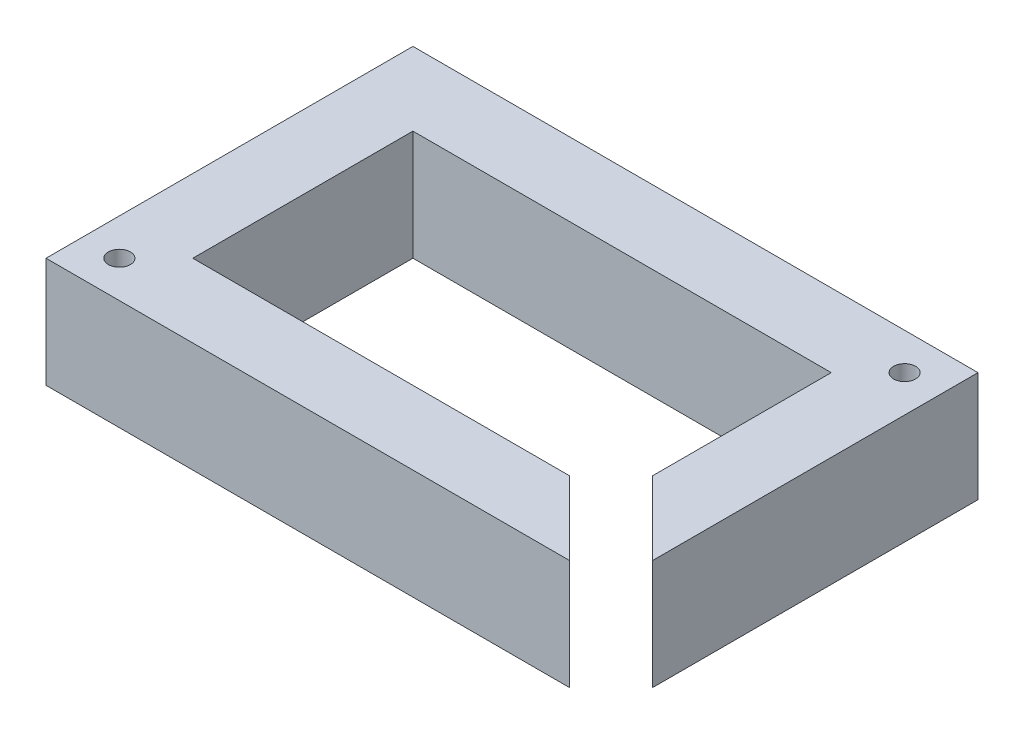
ISO-10303-21;
HEADER;
FILE_DESCRIPTION(('STEP AP214'),'2;1');
FILE_NAME('part.step','',(''),(''),'','','');
FILE_SCHEMA(('AUTOMOTIVE_DESIGN { 1 0 10303 214 1 1 1 1 }'));
ENDSEC;
DATA;
#1=APPLICATION_CONTEXT('core data for automotive mechanical design processes');
#2=APPLICATION_PROTOCOL_DEFINITION('international standard','automotive_design',2000,#1);
#3=PRODUCT_CONTEXT('',#1,'mechanical');
#4=PRODUCT('Part','Part','',(#3));
#5=PRODUCT_RELATED_PRODUCT_CATEGORY('part','',(#4));
#6=PRODUCT_DEFINITION_FORMATION('','',#4);
#7=PRODUCT_DEFINITION_CONTEXT('part definition',#1,'design');
#8=PRODUCT_DEFINITION('design','',#6,#7);
#9=PRODUCT_DEFINITION_SHAPE('','',#8);
#10=(LENGTH_UNIT() NAMED_UNIT(*) SI_UNIT(.MILLI.,.METRE.));
#11=(NAMED_UNIT(*) PLANE_ANGLE_UNIT() SI_UNIT($,.RADIAN.));
#12=(NAMED_UNIT(*) SI_UNIT($,.STERADIAN.) SOLID_ANGLE_UNIT());
#13=UNCERTAINTY_MEASURE_WITH_UNIT(LENGTH_MEASURE(1.E-05),#10,'distance_accuracy_value','');
#14=(GEOMETRIC_REPRESENTATION_CONTEXT(3) GLOBAL_UNCERTAINTY_ASSIGNED_CONTEXT((#13)) GLOBAL_UNIT_ASSIGNED_CONTEXT((#10,
#11,#12)) REPRESENTATION_CONTEXT('',''));
#15=CARTESIAN_POINT('',(0.,0.,0.));
#16=DIRECTION('',(0.,0.,1.));
#17=DIRECTION('',(1.,0.,0.));
#18=AXIS2_PLACEMENT_3D('',#15,#16,#17);
#19=CARTESIAN_POINT('',(57.,15.,0.));
#20=DIRECTION('',(-1.,0.,0.));
#21=DIRECTION('',(0.,0.,1.));
#22=AXIS2_PLACEMENT_3D('',#19,#20,#21);
#23=PLANE('',#22);
#24=DIRECTION('',(0.,0.,-1.));
#25=VECTOR('',#24,1.);
#26=CARTESIAN_POINT('',(57.,0.,0.));
#27=LINE('',#26,#25);
#28=CARTESIAN_POINT('',(57.,0.,-5.65685424949235));
#29=VERTEX_POINT('',#28);
#30=CARTESIAN_POINT('',(57.,0.,-30.));
#31=VERTEX_POINT('',#30);
#32=EDGE_CURVE('E152',#29,#31,#27,.T.);
#33=ORIENTED_EDGE('',*,*,#32,.F.);
#34=DIRECTION('',(0.,-1.,0.));
#35=VECTOR('',#34,1.);
#36=CARTESIAN_POINT('',(57.,15.,-5.65685424949235));
#37=LINE('',#36,#35);
#38=CARTESIAN_POINT('',(57.,15.,-5.65685424949235));
#39=VERTEX_POINT('',#38);
#40=EDGE_CURVE('E11',#39,#29,#37,.T.);
#41=ORIENTED_EDGE('',*,*,#40,.F.);
#42=DIRECTION('',(0.,0.,-1.));
#43=VECTOR('',#42,1.);
#44=CARTESIAN_POINT('',(57.,15.,0.));
#45=LINE('',#44,#43);
#46=CARTESIAN_POINT('',(57.,15.,-30.));
#47=VERTEX_POINT('',#46);
#48=EDGE_CURVE('E345',#39,#47,#45,.T.);
#49=ORIENTED_EDGE('',*,*,#48,.T.);
#50=DIRECTION('',(0.,-1.,0.));
#51=VECTOR('',#50,1.);
#52=CARTESIAN_POINT('',(57.,15.,-30.));
#53=LINE('',#52,#51);
#54=EDGE_CURVE('E94',#47,#31,#53,.T.);
#55=ORIENTED_EDGE('',*,*,#54,.T.);
#56=EDGE_LOOP('',(#33,#41,#49,#55));
#57=FACE_BOUND('',#56,.T.);
#58=ADVANCED_FACE('F36',(#57),#23,.T.);
#59=CARTESIAN_POINT('',(31.3284271247462,15.,-31.3284271247462));
#60=DIRECTION('',(0.707106781186547,0.,-0.707106781186548));
#61=DIRECTION('',(-0.707106781186548,0.,-0.707106781186547));
#62=AXIS2_PLACEMENT_3D('',#59,#60,#61);
#63=PLANE('',#62);
#64=DIRECTION('',(0.707106781186548,0.,0.707106781186547));
#65=VECTOR('',#64,1.);
#66=CARTESIAN_POINT('',(31.3284271247462,0.,-31.3284271247462));
#67=LINE('',#66,#65);
#68=CARTESIAN_POINT('',(67.,0.,4.34314575050763));
#69=VERTEX_POINT('',#68);
#70=EDGE_CURVE('E154',#29,#69,#67,.T.);
#71=ORIENTED_EDGE('',*,*,#70,.T.);
#72=DIRECTION('',(0.,-1.,0.));
#73=VECTOR('',#72,1.);
#74=CARTESIAN_POINT('',(67.,15.,4.34314575050763));
#75=LINE('',#74,#73);
#76=CARTESIAN_POINT('',(67.,15.,4.34314575050763));
#77=VERTEX_POINT('',#76);
#78=EDGE_CURVE('E45',#77,#69,#75,.T.);
#79=ORIENTED_EDGE('',*,*,#78,.F.);
#80=DIRECTION('',(0.707106781186548,0.,0.707106781186547));
#81=VECTOR('',#80,1.);
#82=CARTESIAN_POINT('',(31.3284271247462,15.,-31.3284271247462));
#83=LINE('',#82,#81);
#84=EDGE_CURVE('E343',#39,#77,#83,.T.);
#85=ORIENTED_EDGE('',*,*,#84,.F.);
#86=ORIENTED_EDGE('',*,*,#40,.T.);
#87=EDGE_LOOP('',(#71,#79,#85,#86));
#88=FACE_BOUND('',#87,.T.);
#89=ADVANCED_FACE('F196',(#88),#63,.F.);
#90=CARTESIAN_POINT('',(67.,15.,0.));
#91=DIRECTION('',(-1.,0.,0.));
#92=DIRECTION('',(0.,0.,1.));
#93=AXIS2_PLACEMENT_3D('',#90,#91,#92);
#94=PLANE('',#93);
#95=DIRECTION('',(0.,0.,-1.));
#96=VECTOR('',#95,1.);
#97=CARTESIAN_POINT('',(67.,0.,0.));
#98=LINE('',#97,#96);
#99=CARTESIAN_POINT('',(67.,0.,-40.));
#100=VERTEX_POINT('',#99);
#101=EDGE_CURVE('E157',#69,#100,#98,.T.);
#102=ORIENTED_EDGE('',*,*,#101,.T.);
#103=DIRECTION('',(0.,-1.,0.));
#104=VECTOR('',#103,1.);
#105=CARTESIAN_POINT('',(67.,15.,-40.));
#106=LINE('',#105,#104);
#107=CARTESIAN_POINT('',(67.,15.,-40.));
#108=VERTEX_POINT('',#107);
#109=EDGE_CURVE('E186',#108,#100,#106,.T.);
#110=ORIENTED_EDGE('',*,*,#109,.F.);
#111=DIRECTION('',(0.,0.,-1.));
#112=VECTOR('',#111,1.);
#113=CARTESIAN_POINT('',(67.,15.,0.));
#114=LINE('',#113,#112);
#115=EDGE_CURVE('E192',#77,#108,#114,.T.);
#116=ORIENTED_EDGE('',*,*,#115,.F.);
#117=ORIENTED_EDGE('',*,*,#78,.T.);
#118=EDGE_LOOP('',(#102,#110,#116,#117));
#119=FACE_BOUND('',#118,.T.);
#120=ADVANCED_FACE('F190',(#119),#94,.F.);
#121=CARTESIAN_POINT('',(0.,15.,-40.));
#122=DIRECTION('',(0.,0.,-1.));
#123=DIRECTION('',(-1.,0.,0.));
#124=AXIS2_PLACEMENT_3D('',#121,#122,#123);
#125=PLANE('',#124);
#126=DIRECTION('',(1.,0.,0.));
#127=VECTOR('',#126,1.);
#128=CARTESIAN_POINT('',(0.,0.,-40.));
#129=LINE('',#128,#127);
#130=CARTESIAN_POINT('',(-10.,0.,-40.));
#131=VERTEX_POINT('',#130);
#132=EDGE_CURVE('E160',#131,#100,#129,.T.);
#133=ORIENTED_EDGE('',*,*,#132,.F.);
#134=DIRECTION('',(0.,-1.,0.));
#135=VECTOR('',#134,1.);
#136=CARTESIAN_POINT('',(-10.,15.,-40.));
#137=LINE('',#136,#135);
#138=CARTESIAN_POINT('',(-10.,15.,-40.));
#139=VERTEX_POINT('',#138);
#140=EDGE_CURVE('E184',#139,#131,#137,.T.);
#141=ORIENTED_EDGE('',*,*,#140,.F.);
#142=DIRECTION('',(1.,0.,0.));
#143=VECTOR('',#142,1.);
#144=CARTESIAN_POINT('',(0.,15.,-40.));
#145=LINE('',#144,#143);
#146=EDGE_CURVE('E338',#139,#108,#145,.T.);
#147=ORIENTED_EDGE('',*,*,#146,.T.);
#148=ORIENTED_EDGE('',*,*,#109,.T.);
#149=EDGE_LOOP('',(#133,#141,#147,#148));
#150=FACE_BOUND('',#149,.T.);
#151=ADVANCED_FACE('F246',(#150),#125,.T.);
#152=CARTESIAN_POINT('',(-10.,15.,0.));
#153=DIRECTION('',(-1.,0.,0.));
#154=DIRECTION('',(0.,0.,1.));
#155=AXIS2_PLACEMENT_3D('',#152,#153,#154);
#156=PLANE('',#155);
#157=DIRECTION('',(0.,0.,-1.));
#158=VECTOR('',#157,1.);
#159=CARTESIAN_POINT('',(-10.,0.,0.));
#160=LINE('',#159,#158);
#161=CARTESIAN_POINT('',(-10.,0.,10.));
#162=VERTEX_POINT('',#161);
#163=EDGE_CURVE('E163',#162,#131,#160,.T.);
#164=ORIENTED_EDGE('',*,*,#163,.F.);
#165=DIRECTION('',(0.,-1.,0.));
#166=VECTOR('',#165,1.);
#167=CARTESIAN_POINT('',(-10.,15.,10.));
#168=LINE('',#167,#166);
#169=CARTESIAN_POINT('',(-10.,15.,10.));
#170=VERTEX_POINT('',#169);
#171=EDGE_CURVE('E182',#170,#162,#168,.T.);
#172=ORIENTED_EDGE('',*,*,#171,.F.);
#173=DIRECTION('',(0.,0.,-1.));
#174=VECTOR('',#173,1.);
#175=CARTESIAN_POINT('',(-10.,15.,0.));
#176=LINE('',#175,#174);
#177=EDGE_CURVE('E337',#170,#139,#176,.T.);
#178=ORIENTED_EDGE('',*,*,#177,.T.);
#179=ORIENTED_EDGE('',*,*,#140,.T.);
#180=EDGE_LOOP('',(#164,#172,#178,#179));
#181=FACE_BOUND('',#180,.T.);
#182=ADVANCED_FACE('F242',(#181),#156,.T.);
#183=CARTESIAN_POINT('',(0.,15.,10.));
#184=DIRECTION('',(0.,0.,-1.));
#185=DIRECTION('',(-1.,0.,0.));
#186=AXIS2_PLACEMENT_3D('',#183,#184,#185);
#187=PLANE('',#186);
#188=DIRECTION('',(1.,0.,0.));
#189=VECTOR('',#188,1.);
#190=CARTESIAN_POINT('',(0.,0.,10.));
#191=LINE('',#190,#189);
#192=CARTESIAN_POINT('',(61.3431457505076,0.,10.));
#193=VERTEX_POINT('',#192);
#194=EDGE_CURVE('E166',#162,#193,#191,.T.);
#195=ORIENTED_EDGE('',*,*,#194,.T.);
#196=DIRECTION('',(0.,-1.,0.));
#197=VECTOR('',#196,1.);
#198=CARTESIAN_POINT('',(61.3431457505076,15.,10.));
#199=LINE('',#198,#197);
#200=CARTESIAN_POINT('',(61.3431457505076,15.,10.));
#201=VERTEX_POINT('',#200);
#202=EDGE_CURVE('E180',#201,#193,#199,.T.);
#203=ORIENTED_EDGE('',*,*,#202,.F.);
#204=DIRECTION('',(1.,0.,0.));
#205=VECTOR('',#204,1.);
#206=CARTESIAN_POINT('',(0.,15.,10.));
#207=LINE('',#206,#205);
#208=EDGE_CURVE('E141',#170,#201,#207,.T.);
#209=ORIENTED_EDGE('',*,*,#208,.F.);
#210=ORIENTED_EDGE('',*,*,#171,.T.);
#211=EDGE_LOOP('',(#195,#203,#209,#210));
#212=FACE_BOUND('',#211,.T.);
#213=ADVANCED_FACE('F238',(#212),#187,.F.);
#214=CARTESIAN_POINT('',(25.6715728752538,15.,-25.6715728752538));
#215=DIRECTION('',(0.707106781186548,0.,-0.707106781186547));
#216=DIRECTION('',(-0.707106781186547,0.,-0.707106781186548));
#217=AXIS2_PLACEMENT_3D('',#214,#215,#216);
#218=PLANE('',#217);
#219=DIRECTION('',(0.707106781186547,0.,0.707106781186548));
#220=VECTOR('',#219,1.);
#221=CARTESIAN_POINT('',(25.6715728752538,0.,-25.6715728752538));
#222=LINE('',#221,#220);
#223=CARTESIAN_POINT('',(51.3431457505076,0.,0.));
#224=VERTEX_POINT('',#223);
#225=EDGE_CURVE('E169',#224,#193,#222,.T.);
#226=ORIENTED_EDGE('',*,*,#225,.F.);
#227=DIRECTION('',(0.,-1.,0.));
#228=VECTOR('',#227,1.);
#229=CARTESIAN_POINT('',(51.3431457505076,15.,0.));
#230=LINE('',#229,#228);
#231=CARTESIAN_POINT('',(51.3431457505076,15.,0.));
#232=VERTEX_POINT('',#231);
#233=EDGE_CURVE('E129',#232,#224,#230,.T.);
#234=ORIENTED_EDGE('',*,*,#233,.F.);
#235=DIRECTION('',(0.707106781186547,0.,0.707106781186548));
#236=VECTOR('',#235,1.);
#237=CARTESIAN_POINT('',(25.6715728752538,15.,-25.6715728752538));
#238=LINE('',#237,#236);
#239=EDGE_CURVE('E139',#232,#201,#238,.T.);
#240=ORIENTED_EDGE('',*,*,#239,.T.);
#241=ORIENTED_EDGE('',*,*,#202,.T.);
#242=EDGE_LOOP('',(#226,#234,#240,#241));
#243=FACE_BOUND('',#242,.T.);
#244=ADVANCED_FACE('F235',(#243),#218,.T.);
#245=CARTESIAN_POINT('',(0.,15.,0.));
#246=DIRECTION('',(0.,0.,-1.));
#247=DIRECTION('',(-1.,0.,0.));
#248=AXIS2_PLACEMENT_3D('',#245,#246,#247);
#249=PLANE('',#248);
#250=DIRECTION('',(1.,0.,0.));
#251=VECTOR('',#250,1.);
#252=CARTESIAN_POINT('',(0.,0.,0.));
#253=LINE('',#252,#251);
#254=CARTESIAN_POINT('',(0.,0.,0.));
#255=VERTEX_POINT('',#254);
#256=EDGE_CURVE('E126',#255,#224,#253,.T.);
#257=ORIENTED_EDGE('',*,*,#256,.F.);
#258=DIRECTION('',(0.,-1.,0.));
#259=VECTOR('',#258,1.);
#260=CARTESIAN_POINT('',(0.,15.,0.));
#261=LINE('',#260,#259);
#262=CARTESIAN_POINT('',(0.,15.,0.));
#263=VERTEX_POINT('',#262);
#264=EDGE_CURVE('E120',#263,#255,#261,.T.);
#265=ORIENTED_EDGE('',*,*,#264,.F.);
#266=DIRECTION('',(1.,0.,0.));
#267=VECTOR('',#266,1.);
#268=CARTESIAN_POINT('',(0.,15.,0.));
#269=LINE('',#268,#267);
#270=EDGE_CURVE('E124',#263,#232,#269,.T.);
#271=ORIENTED_EDGE('',*,*,#270,.T.);
#272=ORIENTED_EDGE('',*,*,#233,.T.);
#273=EDGE_LOOP('',(#257,#265,#271,#272));
#274=FACE_BOUND('',#273,.T.);
#275=ADVANCED_FACE('F122',(#274),#249,.T.);
#276=CARTESIAN_POINT('',(0.,15.,0.));
#277=DIRECTION('',(-1.,0.,0.));
#278=DIRECTION('',(0.,0.,1.));
#279=AXIS2_PLACEMENT_3D('',#276,#277,#278);
#280=PLANE('',#279);
#281=DIRECTION('',(0.,0.,-1.));
#282=VECTOR('',#281,1.);
#283=CARTESIAN_POINT('',(0.,0.,0.));
#284=LINE('',#283,#282);
#285=CARTESIAN_POINT('',(0.,0.,-30.));
#286=VERTEX_POINT('',#285);
#287=EDGE_CURVE('E173',#255,#286,#284,.T.);
#288=ORIENTED_EDGE('',*,*,#287,.T.);
#289=DIRECTION('',(0.,-1.,0.));
#290=VECTOR('',#289,1.);
#291=CARTESIAN_POINT('',(0.,15.,-30.));
#292=LINE('',#291,#290);
#293=CARTESIAN_POINT('',(0.,15.,-30.));
#294=VERTEX_POINT('',#293);
#295=EDGE_CURVE('E130',#294,#286,#292,.T.);
#296=ORIENTED_EDGE('',*,*,#295,.F.);
#297=DIRECTION('',(0.,0.,-1.));
#298=VECTOR('',#297,1.);
#299=CARTESIAN_POINT('',(0.,15.,0.));
#300=LINE('',#299,#298);
#301=EDGE_CURVE('E133',#263,#294,#300,.T.);
#302=ORIENTED_EDGE('',*,*,#301,.F.);
#303=ORIENTED_EDGE('',*,*,#264,.T.);
#304=EDGE_LOOP('',(#288,#296,#302,#303));
#305=FACE_BOUND('',#304,.T.);
#306=ADVANCED_FACE('F134',(#305),#280,.F.);
#307=CARTESIAN_POINT('',(-5.,15.,5.));
#308=DIRECTION('',(0.,-1.,0.));
#309=DIRECTION('',(0.,0.,-1.));
#310=AXIS2_PLACEMENT_3D('',#307,#308,#309);
#311=CYLINDRICAL_SURFACE('',#310,1.5);
#312=CARTESIAN_POINT('',(-5.,15.,5.));
#313=DIRECTION('',(0.,1.,0.));
#314=DIRECTION('',(0.,0.,1.));
#315=AXIS2_PLACEMENT_3D('',#312,#313,#314);
#316=CIRCLE('',#315,1.5);
#317=CARTESIAN_POINT('',(-5.,15.,6.5));
#318=VERTEX_POINT('',#317);
#319=EDGE_CURVE('E218',#318,#318,#316,.T.);
#320=ORIENTED_EDGE('',*,*,#319,.T.);
#321=EDGE_LOOP('',(#320));
#322=FACE_BOUND('',#321,.T.);
#323=CARTESIAN_POINT('',(-5.,0.,5.));
#324=DIRECTION('',(0.,1.,0.));
#325=DIRECTION('',(0.,0.,1.));
#326=AXIS2_PLACEMENT_3D('',#323,#324,#325);
#327=CIRCLE('',#326,1.5);
#328=CARTESIAN_POINT('',(-5.,0.,6.5));
#329=VERTEX_POINT('',#328);
#330=EDGE_CURVE('E149',#329,#329,#327,.T.);
#331=ORIENTED_EDGE('',*,*,#330,.F.);
#332=EDGE_LOOP('',(#331));
#333=FACE_BOUND('',#332,.T.);
#334=ADVANCED_FACE('F205',(#322,#333),#311,.F.);
#335=CARTESIAN_POINT('',(62.,15.,-35.));
#336=DIRECTION('',(0.,-1.,0.));
#337=DIRECTION('',(0.,0.,-1.));
#338=AXIS2_PLACEMENT_3D('',#335,#336,#337);
#339=CYLINDRICAL_SURFACE('',#338,1.5);
#340=CARTESIAN_POINT('',(62.,15.,-35.));
#341=DIRECTION('',(0.,1.,0.));
#342=DIRECTION('',(0.,0.,1.));
#343=AXIS2_PLACEMENT_3D('',#340,#341,#342);
#344=CIRCLE('',#343,1.5);
#345=CARTESIAN_POINT('',(62.,15.,-33.5));
#346=VERTEX_POINT('',#345);
#347=EDGE_CURVE('E176',#346,#346,#344,.T.);
#348=ORIENTED_EDGE('',*,*,#347,.T.);
#349=EDGE_LOOP('',(#348));
#350=FACE_BOUND('',#349,.T.);
#351=CARTESIAN_POINT('',(62.,0.,-35.));
#352=DIRECTION('',(0.,1.,0.));
#353=DIRECTION('',(0.,0.,1.));
#354=AXIS2_PLACEMENT_3D('',#351,#352,#353);
#355=CIRCLE('',#354,1.5);
#356=CARTESIAN_POINT('',(62.,0.,-33.5));
#357=VERTEX_POINT('',#356);
#358=EDGE_CURVE('E146',#357,#357,#355,.T.);
#359=ORIENTED_EDGE('',*,*,#358,.F.);
#360=EDGE_LOOP('',(#359));
#361=FACE_BOUND('',#360,.T.);
#362=ADVANCED_FACE('F38',(#350,#361),#339,.F.);
#363=CARTESIAN_POINT('',(0.,15.,-30.));
#364=DIRECTION('',(0.,0.,-1.));
#365=DIRECTION('',(-1.,0.,0.));
#366=AXIS2_PLACEMENT_3D('',#363,#364,#365);
#367=PLANE('',#366);
#368=DIRECTION('',(1.,0.,0.));
#369=VECTOR('',#368,1.);
#370=CARTESIAN_POINT('',(0.,0.,-30.));
#371=LINE('',#370,#369);
#372=EDGE_CURVE('E87',#286,#31,#371,.T.);
#373=ORIENTED_EDGE('',*,*,#372,.T.);
#374=ORIENTED_EDGE('',*,*,#54,.F.);
#375=DIRECTION('',(1.,0.,0.));
#376=VECTOR('',#375,1.);
#377=CARTESIAN_POINT('',(0.,15.,-30.));
#378=LINE('',#377,#376);
#379=EDGE_CURVE('E53',#294,#47,#378,.T.);
#380=ORIENTED_EDGE('',*,*,#379,.F.);
#381=ORIENTED_EDGE('',*,*,#295,.T.);
#382=EDGE_LOOP('',(#373,#374,#380,#381));
#383=FACE_BOUND('',#382,.T.);
#384=ADVANCED_FACE('F212',(#383),#367,.F.);
#385=CARTESIAN_POINT('',(0.,15.,0.));
#386=DIRECTION('',(0.,1.,0.));
#387=DIRECTION('',(0.,0.,1.));
#388=AXIS2_PLACEMENT_3D('',#385,#386,#387);
#389=PLANE('',#388);
#390=ORIENTED_EDGE('',*,*,#347,.F.);
#391=EDGE_LOOP('',(#390));
#392=FACE_BOUND('',#391,.T.);
#393=ORIENTED_EDGE('',*,*,#319,.F.);
#394=EDGE_LOOP('',(#393));
#395=FACE_BOUND('',#394,.T.);
#396=ORIENTED_EDGE('',*,*,#48,.F.);
#397=ORIENTED_EDGE('',*,*,#84,.T.);
#398=ORIENTED_EDGE('',*,*,#115,.T.);
#399=ORIENTED_EDGE('',*,*,#146,.F.);
#400=ORIENTED_EDGE('',*,*,#177,.F.);
#401=ORIENTED_EDGE('',*,*,#208,.T.);
#402=ORIENTED_EDGE('',*,*,#239,.F.);
#403=ORIENTED_EDGE('',*,*,#270,.F.);
#404=ORIENTED_EDGE('',*,*,#301,.T.);
#405=ORIENTED_EDGE('',*,*,#379,.T.);
#406=EDGE_LOOP('',(#396,#397,#398,#399,#400,#401,#402,#403,#404,#405));
#407=FACE_BOUND('',#406,.T.);
#408=ADVANCED_FACE('F137',(#392,#395,#407),#389,.T.);
#409=CARTESIAN_POINT('',(0.,0.,0.));
#410=DIRECTION('',(0.,1.,0.));
#411=DIRECTION('',(0.,0.,1.));
#412=AXIS2_PLACEMENT_3D('',#409,#410,#411);
#413=PLANE('',#412);
#414=ORIENTED_EDGE('',*,*,#358,.T.);
#415=EDGE_LOOP('',(#414));
#416=FACE_BOUND('',#415,.T.);
#417=ORIENTED_EDGE('',*,*,#330,.T.);
#418=EDGE_LOOP('',(#417));
#419=FACE_BOUND('',#418,.T.);
#420=ORIENTED_EDGE('',*,*,#32,.T.);
#421=ORIENTED_EDGE('',*,*,#372,.F.);
#422=ORIENTED_EDGE('',*,*,#287,.F.);
#423=ORIENTED_EDGE('',*,*,#256,.T.);
#424=ORIENTED_EDGE('',*,*,#225,.T.);
#425=ORIENTED_EDGE('',*,*,#194,.F.);
#426=ORIENTED_EDGE('',*,*,#163,.T.);
#427=ORIENTED_EDGE('',*,*,#132,.T.);
#428=ORIENTED_EDGE('',*,*,#101,.F.);
#429=ORIENTED_EDGE('',*,*,#70,.F.);
#430=EDGE_LOOP('',(#420,#421,#422,#423,#424,#425,#426,#427,#428,#429));
#431=FACE_BOUND('',#430,.T.);
#432=ADVANCED_FACE('F197',(#416,#419,#431),#413,.F.);
#433=CLOSED_SHELL('',(#58,#89,#120,#151,#182,#213,#244,#275,#306,#334,#362,#384,#408,#432));
#434=MANIFOLD_SOLID_BREP('B2',#433);
#435=ADVANCED_BREP_SHAPE_REPRESENTATION('',(#18,#434),#14);
#436=SHAPE_DEFINITION_REPRESENTATION(#9,#435);
ENDSEC;
END-ISO-10303-21;
